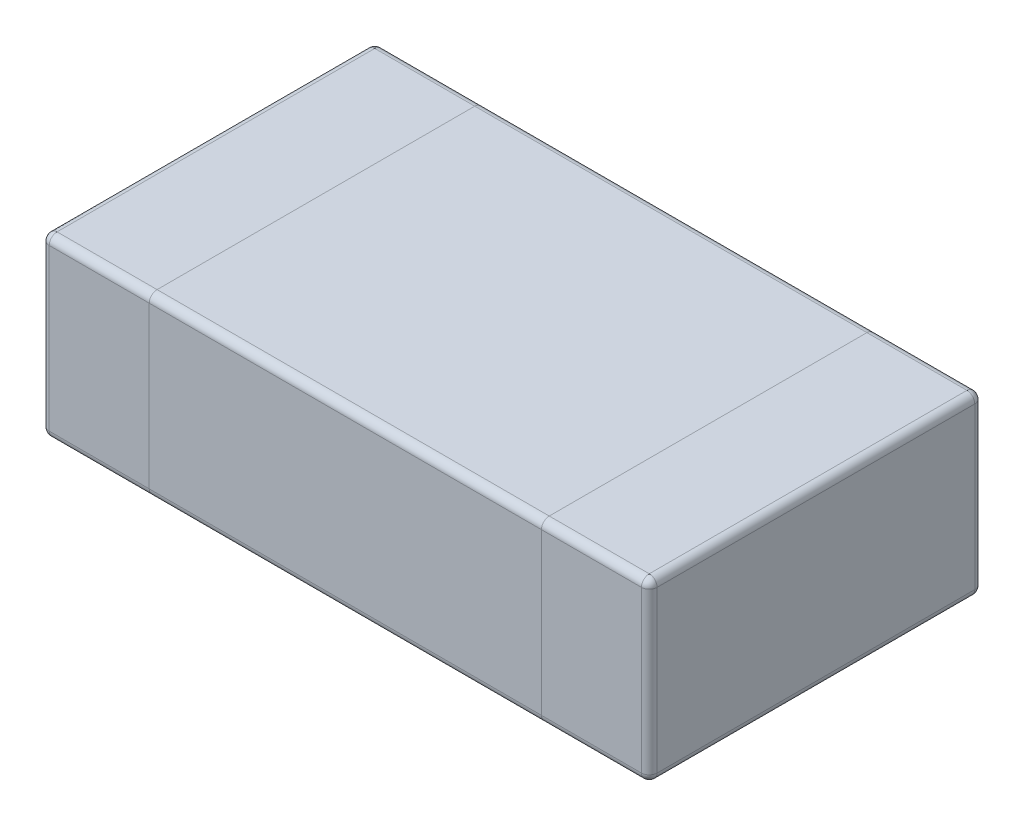
ISO-10303-21;
HEADER;
FILE_DESCRIPTION(('STEP AP214'),'2;1');
FILE_NAME('part.step','',(''),(''),'','','');
FILE_SCHEMA(('AUTOMOTIVE_DESIGN { 1 0 10303 214 1 1 1 1 }'));
ENDSEC;
DATA;
#1=APPLICATION_CONTEXT('core data for automotive mechanical design processes');
#2=APPLICATION_PROTOCOL_DEFINITION('international standard','automotive_design',2000,#1);
#3=PRODUCT_CONTEXT('',#1,'mechanical');
#4=PRODUCT('Part','Part','',(#3));
#5=PRODUCT_RELATED_PRODUCT_CATEGORY('part','',(#4));
#6=PRODUCT_DEFINITION_FORMATION('','',#4);
#7=PRODUCT_DEFINITION_CONTEXT('part definition',#1,'design');
#8=PRODUCT_DEFINITION('design','',#6,#7);
#9=PRODUCT_DEFINITION_SHAPE('','',#8);
#10=(LENGTH_UNIT() NAMED_UNIT(*) SI_UNIT(.MILLI.,.METRE.));
#11=(NAMED_UNIT(*) PLANE_ANGLE_UNIT() SI_UNIT($,.RADIAN.));
#12=(NAMED_UNIT(*) SI_UNIT($,.STERADIAN.) SOLID_ANGLE_UNIT());
#13=UNCERTAINTY_MEASURE_WITH_UNIT(LENGTH_MEASURE(1.E-05),#10,'distance_accuracy_value','');
#14=(GEOMETRIC_REPRESENTATION_CONTEXT(3) GLOBAL_UNCERTAINTY_ASSIGNED_CONTEXT((#13)) GLOBAL_UNIT_ASSIGNED_CONTEXT((#10,
#11,#12)) REPRESENTATION_CONTEXT('',''));
#15=CARTESIAN_POINT('',(0.,0.,0.));
#16=DIRECTION('',(0.,0.,1.));
#17=DIRECTION('',(1.,0.,0.));
#18=AXIS2_PLACEMENT_3D('',#15,#16,#17);
#19=CARTESIAN_POINT('',(-0.755,-0.225,0.405));
#20=DIRECTION('',(0.,1.,0.));
#21=DIRECTION('',(0.,0.,1.));
#22=AXIS2_PLACEMENT_3D('',#19,#20,#21);
#23=PLANE('',#22);
#24=DIRECTION('',(0.,0.,-1.));
#25=VECTOR('',#24,1.);
#26=CARTESIAN_POINT('',(-0.5,-0.225,0.405));
#27=LINE('',#26,#25);
#28=CARTESIAN_POINT('',(-0.5,-0.225,0.405));
#29=VERTEX_POINT('',#28);
#30=CARTESIAN_POINT('',(-0.5,-0.225,-0.405));
#31=VERTEX_POINT('',#30);
#32=EDGE_CURVE('E207',#29,#31,#27,.T.);
#33=ORIENTED_EDGE('',*,*,#32,.F.);
#34=DIRECTION('',(1.,0.,0.));
#35=VECTOR('',#34,1.);
#36=CARTESIAN_POINT('',(-0.755,-0.225,0.405));
#37=LINE('',#36,#35);
#38=CARTESIAN_POINT('',(-0.755,-0.225,0.405));
#39=VERTEX_POINT('',#38);
#40=EDGE_CURVE('E230',#29,#39,#37,.F.);
#41=ORIENTED_EDGE('',*,*,#40,.T.);
#42=DIRECTION('',(0.,0.,1.));
#43=VECTOR('',#42,1.);
#44=CARTESIAN_POINT('',(-0.755,-0.225,0.405));
#45=LINE('',#44,#43);
#46=CARTESIAN_POINT('',(-0.755,-0.225,-0.405));
#47=VERTEX_POINT('',#46);
#48=EDGE_CURVE('E228',#39,#47,#45,.F.);
#49=ORIENTED_EDGE('',*,*,#48,.T.);
#50=DIRECTION('',(-1.,0.,0.));
#51=VECTOR('',#50,1.);
#52=CARTESIAN_POINT('',(-0.755,-0.225,-0.405));
#53=LINE('',#52,#51);
#54=EDGE_CURVE('E226',#47,#31,#53,.F.);
#55=ORIENTED_EDGE('',*,*,#54,.T.);
#56=EDGE_LOOP('',(#33,#41,#49,#55));
#57=FACE_BOUND('',#56,.T.);
#58=ADVANCED_FACE('F36',(#57),#23,.F.);
#59=DIRECTION('',(0.,0.,-1.));
#60=VECTOR('',#59,1.);
#61=CARTESIAN_POINT('',(0.5,-0.225,0.405));
#62=LINE('',#61,#60);
#63=CARTESIAN_POINT('',(0.5,-0.225,0.405));
#64=VERTEX_POINT('',#63);
#65=CARTESIAN_POINT('',(0.5,-0.225,-0.405));
#66=VERTEX_POINT('',#65);
#67=EDGE_CURVE('E213',#64,#66,#62,.T.);
#68=ORIENTED_EDGE('',*,*,#67,.F.);
#69=DIRECTION('',(1.,0.,0.));
#70=VECTOR('',#69,1.);
#71=CARTESIAN_POINT('',(-0.755,-0.225,0.405));
#72=LINE('',#71,#70);
#73=EDGE_CURVE('E218',#64,#29,#72,.F.);
#74=ORIENTED_EDGE('',*,*,#73,.T.);
#75=ORIENTED_EDGE('',*,*,#32,.T.);
#76=DIRECTION('',(-1.,0.,0.));
#77=VECTOR('',#76,1.);
#78=CARTESIAN_POINT('',(-0.755,-0.225,-0.405));
#79=LINE('',#78,#77);
#80=EDGE_CURVE('E209',#31,#66,#79,.F.);
#81=ORIENTED_EDGE('',*,*,#80,.T.);
#82=EDGE_LOOP('',(#68,#74,#75,#81));
#83=FACE_BOUND('',#82,.T.);
#84=ADVANCED_FACE('F444',(#83),#23,.F.);
#85=CARTESIAN_POINT('',(-0.755,0.225,-0.425));
#86=DIRECTION('',(0.,0.,1.));
#87=DIRECTION('',(1.,0.,0.));
#88=AXIS2_PLACEMENT_3D('',#85,#86,#87);
#89=PLANE('',#88);
#90=DIRECTION('',(0.,-1.,0.));
#91=VECTOR('',#90,1.);
#92=CARTESIAN_POINT('',(0.5,0.225,-0.425));
#93=LINE('',#92,#91);
#94=CARTESIAN_POINT('',(0.5,0.205,-0.425));
#95=VERTEX_POINT('',#94);
#96=CARTESIAN_POINT('',(0.5,-0.205,-0.425));
#97=VERTEX_POINT('',#96);
#98=EDGE_CURVE('E193',#95,#97,#93,.T.);
#99=ORIENTED_EDGE('',*,*,#98,.T.);
#100=DIRECTION('',(-1.,0.,0.));
#101=VECTOR('',#100,1.);
#102=CARTESIAN_POINT('',(-0.755,-0.205,-0.425));
#103=LINE('',#102,#101);
#104=CARTESIAN_POINT('',(-0.5,-0.205,-0.425));
#105=VERTEX_POINT('',#104);
#106=EDGE_CURVE('E250',#97,#105,#103,.T.);
#107=ORIENTED_EDGE('',*,*,#106,.T.);
#108=DIRECTION('',(0.,-1.,0.));
#109=VECTOR('',#108,1.);
#110=CARTESIAN_POINT('',(-0.5,0.225,-0.425));
#111=LINE('',#110,#109);
#112=CARTESIAN_POINT('',(-0.5,0.205,-0.425));
#113=VERTEX_POINT('',#112);
#114=EDGE_CURVE('E400',#113,#105,#111,.T.);
#115=ORIENTED_EDGE('',*,*,#114,.F.);
#116=DIRECTION('',(-1.,0.,0.));
#117=VECTOR('',#116,1.);
#118=CARTESIAN_POINT('',(0.5,0.205,-0.425));
#119=LINE('',#118,#117);
#120=EDGE_CURVE('E248',#113,#95,#119,.F.);
#121=ORIENTED_EDGE('',*,*,#120,.T.);
#122=EDGE_LOOP('',(#99,#107,#115,#121));
#123=FACE_BOUND('',#122,.T.);
#124=ADVANCED_FACE('F505',(#123),#89,.F.);
#125=DIRECTION('',(0.,-1.,0.));
#126=VECTOR('',#125,1.);
#127=CARTESIAN_POINT('',(0.755,0.225,-0.425));
#128=LINE('',#127,#126);
#129=CARTESIAN_POINT('',(0.755,0.205,-0.425));
#130=VERTEX_POINT('',#129);
#131=CARTESIAN_POINT('',(0.755,-0.205,-0.425));
#132=VERTEX_POINT('',#131);
#133=EDGE_CURVE('E365',#130,#132,#128,.T.);
#134=ORIENTED_EDGE('',*,*,#133,.T.);
#135=DIRECTION('',(-1.,0.,0.));
#136=VECTOR('',#135,1.);
#137=CARTESIAN_POINT('',(-0.755,-0.205,-0.425));
#138=LINE('',#137,#136);
#139=EDGE_CURVE('E254',#132,#97,#138,.T.);
#140=ORIENTED_EDGE('',*,*,#139,.T.);
#141=ORIENTED_EDGE('',*,*,#98,.F.);
#142=DIRECTION('',(-1.,0.,0.));
#143=VECTOR('',#142,1.);
#144=CARTESIAN_POINT('',(0.755,0.205,-0.425));
#145=LINE('',#144,#143);
#146=EDGE_CURVE('E252',#95,#130,#145,.F.);
#147=ORIENTED_EDGE('',*,*,#146,.T.);
#148=EDGE_LOOP('',(#134,#140,#141,#147));
#149=FACE_BOUND('',#148,.T.);
#150=ADVANCED_FACE('F364',(#149),#89,.F.);
#151=CARTESIAN_POINT('',(-0.755,0.225,0.425));
#152=DIRECTION('',(0.,0.,-1.));
#153=DIRECTION('',(-1.,0.,0.));
#154=AXIS2_PLACEMENT_3D('',#151,#152,#153);
#155=PLANE('',#154);
#156=DIRECTION('',(0.,-1.,0.));
#157=VECTOR('',#156,1.);
#158=CARTESIAN_POINT('',(-0.5,0.225,0.425));
#159=LINE('',#158,#157);
#160=CARTESIAN_POINT('',(-0.5,0.205,0.425));
#161=VERTEX_POINT('',#160);
#162=CARTESIAN_POINT('',(-0.5,-0.205,0.425));
#163=VERTEX_POINT('',#162);
#164=EDGE_CURVE('E194',#161,#163,#159,.T.);
#165=ORIENTED_EDGE('',*,*,#164,.T.);
#166=DIRECTION('',(1.,0.,0.));
#167=VECTOR('',#166,1.);
#168=CARTESIAN_POINT('',(-0.755,-0.205,0.425));
#169=LINE('',#168,#167);
#170=CARTESIAN_POINT('',(0.5,-0.205,0.425));
#171=VERTEX_POINT('',#170);
#172=EDGE_CURVE('E191',#163,#171,#169,.T.);
#173=ORIENTED_EDGE('',*,*,#172,.T.);
#174=DIRECTION('',(0.,-1.,0.));
#175=VECTOR('',#174,1.);
#176=CARTESIAN_POINT('',(0.5,0.225,0.425));
#177=LINE('',#176,#175);
#178=CARTESIAN_POINT('',(0.5,0.205,0.425));
#179=VERTEX_POINT('',#178);
#180=EDGE_CURVE('E176',#179,#171,#177,.T.);
#181=ORIENTED_EDGE('',*,*,#180,.F.);
#182=DIRECTION('',(1.,0.,0.));
#183=VECTOR('',#182,1.);
#184=CARTESIAN_POINT('',(-0.5,0.205,0.425));
#185=LINE('',#184,#183);
#186=EDGE_CURVE('E188',#179,#161,#185,.F.);
#187=ORIENTED_EDGE('',*,*,#186,.T.);
#188=EDGE_LOOP('',(#165,#173,#181,#187));
#189=FACE_BOUND('',#188,.T.);
#190=ADVANCED_FACE('F186',(#189),#155,.F.);
#191=DIRECTION('',(0.,-1.,0.));
#192=VECTOR('',#191,1.);
#193=CARTESIAN_POINT('',(-0.755,0.225,0.425));
#194=LINE('',#193,#192);
#195=CARTESIAN_POINT('',(-0.755,0.205,0.425));
#196=VERTEX_POINT('',#195);
#197=CARTESIAN_POINT('',(-0.755,-0.205,0.425));
#198=VERTEX_POINT('',#197);
#199=EDGE_CURVE('E386',#196,#198,#194,.T.);
#200=ORIENTED_EDGE('',*,*,#199,.T.);
#201=DIRECTION('',(1.,0.,0.));
#202=VECTOR('',#201,1.);
#203=CARTESIAN_POINT('',(-0.755,-0.205,0.425));
#204=LINE('',#203,#202);
#205=EDGE_CURVE('E224',#198,#163,#204,.T.);
#206=ORIENTED_EDGE('',*,*,#205,.T.);
#207=ORIENTED_EDGE('',*,*,#164,.F.);
#208=DIRECTION('',(1.,0.,0.));
#209=VECTOR('',#208,1.);
#210=CARTESIAN_POINT('',(-0.755,0.205,0.425));
#211=LINE('',#210,#209);
#212=EDGE_CURVE('E221',#161,#196,#211,.F.);
#213=ORIENTED_EDGE('',*,*,#212,.T.);
#214=EDGE_LOOP('',(#200,#206,#207,#213));
#215=FACE_BOUND('',#214,.T.);
#216=ADVANCED_FACE('F480',(#215),#155,.F.);
#217=CARTESIAN_POINT('',(-0.755,0.225,0.405));
#218=DIRECTION('',(0.,1.,0.));
#219=DIRECTION('',(0.,0.,1.));
#220=AXIS2_PLACEMENT_3D('',#217,#218,#219);
#221=PLANE('',#220);
#222=DIRECTION('',(0.,0.,-1.));
#223=VECTOR('',#222,1.);
#224=CARTESIAN_POINT('',(0.755,0.225,-0.405));
#225=LINE('',#224,#223);
#226=CARTESIAN_POINT('',(0.755,0.225,0.405));
#227=VERTEX_POINT('',#226);
#228=CARTESIAN_POINT('',(0.755,0.225,-0.405));
#229=VERTEX_POINT('',#228);
#230=EDGE_CURVE('E53',#227,#229,#225,.T.);
#231=ORIENTED_EDGE('',*,*,#230,.T.);
#232=DIRECTION('',(-1.,0.,0.));
#233=VECTOR('',#232,1.);
#234=CARTESIAN_POINT('',(0.5,0.225,-0.405));
#235=LINE('',#234,#233);
#236=CARTESIAN_POINT('',(0.5,0.225,-0.405));
#237=VERTEX_POINT('',#236);
#238=EDGE_CURVE('E287',#229,#237,#235,.T.);
#239=ORIENTED_EDGE('',*,*,#238,.T.);
#240=DIRECTION('',(0.,0.,1.));
#241=VECTOR('',#240,1.);
#242=CARTESIAN_POINT('',(0.5,0.225,0.405));
#243=LINE('',#242,#241);
#244=CARTESIAN_POINT('',(0.5,0.225,0.405));
#245=VERTEX_POINT('',#244);
#246=EDGE_CURVE('E393',#237,#245,#243,.T.);
#247=ORIENTED_EDGE('',*,*,#246,.T.);
#248=DIRECTION('',(1.,0.,0.));
#249=VECTOR('',#248,1.);
#250=CARTESIAN_POINT('',(0.755,0.225,0.405));
#251=LINE('',#250,#249);
#252=EDGE_CURVE('E58',#245,#227,#251,.T.);
#253=ORIENTED_EDGE('',*,*,#252,.T.);
#254=EDGE_LOOP('',(#231,#239,#247,#253));
#255=FACE_BOUND('',#254,.T.);
#256=ADVANCED_FACE('F491',(#255),#221,.T.);
#257=ORIENTED_EDGE('',*,*,#246,.F.);
#258=DIRECTION('',(-1.,0.,0.));
#259=VECTOR('',#258,1.);
#260=CARTESIAN_POINT('',(-0.5,0.225,-0.405));
#261=LINE('',#260,#259);
#262=CARTESIAN_POINT('',(-0.5,0.225,-0.405));
#263=VERTEX_POINT('',#262);
#264=EDGE_CURVE('E283',#237,#263,#261,.T.);
#265=ORIENTED_EDGE('',*,*,#264,.T.);
#266=DIRECTION('',(0.,0.,1.));
#267=VECTOR('',#266,1.);
#268=CARTESIAN_POINT('',(-0.5,0.225,0.405));
#269=LINE('',#268,#267);
#270=CARTESIAN_POINT('',(-0.5,0.225,0.405));
#271=VERTEX_POINT('',#270);
#272=EDGE_CURVE('E389',#263,#271,#269,.T.);
#273=ORIENTED_EDGE('',*,*,#272,.T.);
#274=DIRECTION('',(1.,0.,0.));
#275=VECTOR('',#274,1.);
#276=CARTESIAN_POINT('',(0.5,0.225,0.405));
#277=LINE('',#276,#275);
#278=EDGE_CURVE('E281',#271,#245,#277,.T.);
#279=ORIENTED_EDGE('',*,*,#278,.T.);
#280=EDGE_LOOP('',(#257,#265,#273,#279));
#281=FACE_BOUND('',#280,.T.);
#282=ADVANCED_FACE('F490',(#281),#221,.T.);
#283=CARTESIAN_POINT('',(-0.755,0.225,0.405));
#284=DIRECTION('',(0.,-1.,0.));
#285=DIRECTION('',(0.,0.,-1.));
#286=AXIS2_PLACEMENT_3D('',#283,#284,#285);
#287=CYLINDRICAL_SURFACE('',#286,0.0200000000000001);
#288=DIRECTION('',(0.,-1.,0.));
#289=VECTOR('',#288,1.);
#290=CARTESIAN_POINT('',(-0.775,0.225,0.405));
#291=LINE('',#290,#289);
#292=CARTESIAN_POINT('',(-0.775,0.205,0.405));
#293=VERTEX_POINT('',#292);
#294=CARTESIAN_POINT('',(-0.775,-0.205,0.405));
#295=VERTEX_POINT('',#294);
#296=EDGE_CURVE('E324',#293,#295,#291,.T.);
#297=ORIENTED_EDGE('',*,*,#296,.T.);
#298=CARTESIAN_POINT('',(-0.755,-0.205,0.405));
#299=DIRECTION('',(0.,-1.,0.));
#300=DIRECTION('',(0.,0.,-1.));
#301=AXIS2_PLACEMENT_3D('',#298,#299,#300);
#302=CIRCLE('',#301,0.0200000000000001);
#303=EDGE_CURVE('E234',#295,#198,#302,.F.);
#304=ORIENTED_EDGE('',*,*,#303,.T.);
#305=ORIENTED_EDGE('',*,*,#199,.F.);
#306=CARTESIAN_POINT('',(-0.755,0.205,0.405));
#307=DIRECTION('',(0.,-1.,0.));
#308=DIRECTION('',(0.,0.,-1.));
#309=AXIS2_PLACEMENT_3D('',#306,#307,#308);
#310=CIRCLE('',#309,0.0200000000000001);
#311=EDGE_CURVE('E232',#196,#293,#310,.T.);
#312=ORIENTED_EDGE('',*,*,#311,.T.);
#313=EDGE_LOOP('',(#297,#304,#305,#312));
#314=FACE_BOUND('',#313,.T.);
#315=ADVANCED_FACE('F469',(#314),#287,.T.);
#316=DIRECTION('',(0.,-1.,0.));
#317=VECTOR('',#316,1.);
#318=CARTESIAN_POINT('',(0.755,0.225,0.425));
#319=LINE('',#318,#317);
#320=CARTESIAN_POINT('',(0.755,0.205,0.425));
#321=VERTEX_POINT('',#320);
#322=CARTESIAN_POINT('',(0.755,-0.205,0.425));
#323=VERTEX_POINT('',#322);
#324=EDGE_CURVE('E178',#321,#323,#319,.T.);
#325=ORIENTED_EDGE('',*,*,#324,.F.);
#326=DIRECTION('',(1.,0.,0.));
#327=VECTOR('',#326,1.);
#328=CARTESIAN_POINT('',(0.5,0.205,0.425));
#329=LINE('',#328,#327);
#330=EDGE_CURVE('E11',#321,#179,#329,.F.);
#331=ORIENTED_EDGE('',*,*,#330,.T.);
#332=ORIENTED_EDGE('',*,*,#180,.T.);
#333=DIRECTION('',(1.,0.,0.));
#334=VECTOR('',#333,1.);
#335=CARTESIAN_POINT('',(-0.755,-0.205,0.425));
#336=LINE('',#335,#334);
#337=EDGE_CURVE('E45',#171,#323,#336,.T.);
#338=ORIENTED_EDGE('',*,*,#337,.T.);
#339=EDGE_LOOP('',(#325,#331,#332,#338));
#340=FACE_BOUND('',#339,.T.);
#341=ADVANCED_FACE('F175',(#340),#155,.F.);
#342=CARTESIAN_POINT('',(0.755,0.225,0.405));
#343=DIRECTION('',(0.,-1.,0.));
#344=DIRECTION('',(0.,0.,-1.));
#345=AXIS2_PLACEMENT_3D('',#342,#343,#344);
#346=CYLINDRICAL_SURFACE('',#345,0.0200000000000001);
#347=ORIENTED_EDGE('',*,*,#324,.T.);
#348=CARTESIAN_POINT('',(0.755,-0.205,0.405));
#349=DIRECTION('',(0.,-1.,0.));
#350=DIRECTION('',(0.,0.,-1.));
#351=AXIS2_PLACEMENT_3D('',#348,#349,#350);
#352=CIRCLE('',#351,0.0200000000000001);
#353=CARTESIAN_POINT('',(0.775,-0.205,0.405));
#354=VERTEX_POINT('',#353);
#355=EDGE_CURVE('E272',#323,#354,#352,.F.);
#356=ORIENTED_EDGE('',*,*,#355,.T.);
#357=DIRECTION('',(0.,-1.,0.));
#358=VECTOR('',#357,1.);
#359=CARTESIAN_POINT('',(0.775,0.225,0.405));
#360=LINE('',#359,#358);
#361=CARTESIAN_POINT('',(0.775,0.205,0.405));
#362=VERTEX_POINT('',#361);
#363=EDGE_CURVE('E376',#362,#354,#360,.T.);
#364=ORIENTED_EDGE('',*,*,#363,.F.);
#365=CARTESIAN_POINT('',(0.755,0.205,0.405));
#366=DIRECTION('',(0.,-1.,0.));
#367=DIRECTION('',(0.,0.,-1.));
#368=AXIS2_PLACEMENT_3D('',#365,#366,#367);
#369=CIRCLE('',#368,0.0200000000000001);
#370=EDGE_CURVE('E270',#362,#321,#369,.T.);
#371=ORIENTED_EDGE('',*,*,#370,.T.);
#372=EDGE_LOOP('',(#347,#356,#364,#371));
#373=FACE_BOUND('',#372,.T.);
#374=ADVANCED_FACE('F830',(#373),#346,.T.);
#375=CARTESIAN_POINT('',(0.775,0.225,0.405));
#376=DIRECTION('',(-1.,0.,0.));
#377=DIRECTION('',(0.,0.,1.));
#378=AXIS2_PLACEMENT_3D('',#375,#376,#377);
#379=PLANE('',#378);
#380=ORIENTED_EDGE('',*,*,#363,.T.);
#381=DIRECTION('',(0.,0.,-1.));
#382=VECTOR('',#381,1.);
#383=CARTESIAN_POINT('',(0.775,-0.205,0.405));
#384=LINE('',#383,#382);
#385=CARTESIAN_POINT('',(0.775,-0.205,-0.405));
#386=VERTEX_POINT('',#385);
#387=EDGE_CURVE('E268',#354,#386,#384,.T.);
#388=ORIENTED_EDGE('',*,*,#387,.T.);
#389=DIRECTION('',(0.,-1.,0.));
#390=VECTOR('',#389,1.);
#391=CARTESIAN_POINT('',(0.775,0.225,-0.405));
#392=LINE('',#391,#390);
#393=CARTESIAN_POINT('',(0.775,0.205,-0.405));
#394=VERTEX_POINT('',#393);
#395=EDGE_CURVE('E373',#394,#386,#392,.T.);
#396=ORIENTED_EDGE('',*,*,#395,.F.);
#397=DIRECTION('',(0.,0.,-1.));
#398=VECTOR('',#397,1.);
#399=CARTESIAN_POINT('',(0.775,0.205,0.405));
#400=LINE('',#399,#398);
#401=EDGE_CURVE('E266',#394,#362,#400,.F.);
#402=ORIENTED_EDGE('',*,*,#401,.T.);
#403=EDGE_LOOP('',(#380,#388,#396,#402));
#404=FACE_BOUND('',#403,.T.);
#405=ADVANCED_FACE('F820',(#404),#379,.F.);
#406=CARTESIAN_POINT('',(0.755,0.225,-0.405));
#407=DIRECTION('',(0.,-1.,0.));
#408=DIRECTION('',(0.,0.,-1.));
#409=AXIS2_PLACEMENT_3D('',#406,#407,#408);
#410=CYLINDRICAL_SURFACE('',#409,0.0200000000000001);
#411=ORIENTED_EDGE('',*,*,#395,.T.);
#412=CARTESIAN_POINT('',(0.755,-0.205,-0.405));
#413=DIRECTION('',(0.,-1.,0.));
#414=DIRECTION('',(0.,0.,-1.));
#415=AXIS2_PLACEMENT_3D('',#412,#413,#414);
#416=CIRCLE('',#415,0.0200000000000001);
#417=EDGE_CURVE('E264',#386,#132,#416,.F.);
#418=ORIENTED_EDGE('',*,*,#417,.T.);
#419=ORIENTED_EDGE('',*,*,#133,.F.);
#420=CARTESIAN_POINT('',(0.755,0.205,-0.405));
#421=DIRECTION('',(0.,-1.,0.));
#422=DIRECTION('',(0.,0.,-1.));
#423=AXIS2_PLACEMENT_3D('',#420,#421,#422);
#424=CIRCLE('',#423,0.0200000000000001);
#425=EDGE_CURVE('E262',#130,#394,#424,.T.);
#426=ORIENTED_EDGE('',*,*,#425,.T.);
#427=EDGE_LOOP('',(#411,#418,#419,#426));
#428=FACE_BOUND('',#427,.T.);
#429=ADVANCED_FACE('F370',(#428),#410,.T.);
#430=ORIENTED_EDGE('',*,*,#114,.T.);
#431=DIRECTION('',(-1.,0.,0.));
#432=VECTOR('',#431,1.);
#433=CARTESIAN_POINT('',(-0.755,-0.205,-0.425));
#434=LINE('',#433,#432);
#435=CARTESIAN_POINT('',(-0.755,-0.205,-0.425));
#436=VERTEX_POINT('',#435);
#437=EDGE_CURVE('E246',#105,#436,#434,.T.);
#438=ORIENTED_EDGE('',*,*,#437,.T.);
#439=DIRECTION('',(0.,-1.,0.));
#440=VECTOR('',#439,1.);
#441=CARTESIAN_POINT('',(-0.755,0.225,-0.425));
#442=LINE('',#441,#440);
#443=CARTESIAN_POINT('',(-0.755,0.205,-0.425));
#444=VERTEX_POINT('',#443);
#445=EDGE_CURVE('E374',#444,#436,#442,.T.);
#446=ORIENTED_EDGE('',*,*,#445,.F.);
#447=DIRECTION('',(-1.,0.,0.));
#448=VECTOR('',#447,1.);
#449=CARTESIAN_POINT('',(-0.5,0.205,-0.425));
#450=LINE('',#449,#448);
#451=EDGE_CURVE('E244',#444,#113,#450,.F.);
#452=ORIENTED_EDGE('',*,*,#451,.T.);
#453=EDGE_LOOP('',(#430,#438,#446,#452));
#454=FACE_BOUND('',#453,.T.);
#455=ADVANCED_FACE('F797',(#454),#89,.F.);
#456=CARTESIAN_POINT('',(-0.755,0.225,-0.405));
#457=DIRECTION('',(0.,-1.,0.));
#458=DIRECTION('',(0.,0.,-1.));
#459=AXIS2_PLACEMENT_3D('',#456,#457,#458);
#460=CYLINDRICAL_SURFACE('',#459,0.0200000000000001);
#461=ORIENTED_EDGE('',*,*,#445,.T.);
#462=CARTESIAN_POINT('',(-0.755,-0.205,-0.405));
#463=DIRECTION('',(0.,-1.,0.));
#464=DIRECTION('',(0.,0.,-1.));
#465=AXIS2_PLACEMENT_3D('',#462,#463,#464);
#466=CIRCLE('',#465,0.0200000000000001);
#467=CARTESIAN_POINT('',(-0.775,-0.205,-0.405));
#468=VERTEX_POINT('',#467);
#469=EDGE_CURVE('E242',#436,#468,#466,.F.);
#470=ORIENTED_EDGE('',*,*,#469,.T.);
#471=DIRECTION('',(0.,-1.,0.));
#472=VECTOR('',#471,1.);
#473=CARTESIAN_POINT('',(-0.775,0.225,-0.405));
#474=LINE('',#473,#472);
#475=CARTESIAN_POINT('',(-0.775,0.205,-0.405));
#476=VERTEX_POINT('',#475);
#477=EDGE_CURVE('E379',#476,#468,#474,.T.);
#478=ORIENTED_EDGE('',*,*,#477,.F.);
#479=CARTESIAN_POINT('',(-0.755,0.205,-0.405));
#480=DIRECTION('',(0.,-1.,0.));
#481=DIRECTION('',(0.,0.,-1.));
#482=AXIS2_PLACEMENT_3D('',#479,#480,#481);
#483=CIRCLE('',#482,0.0200000000000001);
#484=EDGE_CURVE('E240',#476,#444,#483,.T.);
#485=ORIENTED_EDGE('',*,*,#484,.T.);
#486=EDGE_LOOP('',(#461,#470,#478,#485));
#487=FACE_BOUND('',#486,.T.);
#488=ADVANCED_FACE('F787',(#487),#460,.T.);
#489=CARTESIAN_POINT('',(-0.775,0.225,0.405));
#490=DIRECTION('',(1.,0.,0.));
#491=DIRECTION('',(0.,0.,-1.));
#492=AXIS2_PLACEMENT_3D('',#489,#490,#491);
#493=PLANE('',#492);
#494=ORIENTED_EDGE('',*,*,#477,.T.);
#495=DIRECTION('',(0.,0.,1.));
#496=VECTOR('',#495,1.);
#497=CARTESIAN_POINT('',(-0.775,-0.205,0.405));
#498=LINE('',#497,#496);
#499=EDGE_CURVE('E238',#468,#295,#498,.T.);
#500=ORIENTED_EDGE('',*,*,#499,.T.);
#501=ORIENTED_EDGE('',*,*,#296,.F.);
#502=DIRECTION('',(0.,0.,1.));
#503=VECTOR('',#502,1.);
#504=CARTESIAN_POINT('',(-0.775,0.205,-0.405));
#505=LINE('',#504,#503);
#506=EDGE_CURVE('E236',#293,#476,#505,.F.);
#507=ORIENTED_EDGE('',*,*,#506,.T.);
#508=EDGE_LOOP('',(#494,#500,#501,#507));
#509=FACE_BOUND('',#508,.T.);
#510=ADVANCED_FACE('F465',(#509),#493,.F.);
#511=DIRECTION('',(0.,0.,1.));
#512=VECTOR('',#511,1.);
#513=CARTESIAN_POINT('',(-0.755,0.225,0.405));
#514=LINE('',#513,#512);
#515=CARTESIAN_POINT('',(-0.755,0.225,-0.405));
#516=VERTEX_POINT('',#515);
#517=CARTESIAN_POINT('',(-0.755,0.225,0.405));
#518=VERTEX_POINT('',#517);
#519=EDGE_CURVE('E276',#516,#518,#514,.T.);
#520=ORIENTED_EDGE('',*,*,#519,.T.);
#521=DIRECTION('',(1.,0.,0.));
#522=VECTOR('',#521,1.);
#523=CARTESIAN_POINT('',(-0.5,0.225,0.405));
#524=LINE('',#523,#522);
#525=EDGE_CURVE('E278',#518,#271,#524,.T.);
#526=ORIENTED_EDGE('',*,*,#525,.T.);
#527=ORIENTED_EDGE('',*,*,#272,.F.);
#528=DIRECTION('',(-1.,0.,0.));
#529=VECTOR('',#528,1.);
#530=CARTESIAN_POINT('',(-0.755,0.225,-0.405));
#531=LINE('',#530,#529);
#532=EDGE_CURVE('E274',#263,#516,#531,.T.);
#533=ORIENTED_EDGE('',*,*,#532,.T.);
#534=EDGE_LOOP('',(#520,#526,#527,#533));
#535=FACE_BOUND('',#534,.T.);
#536=ADVANCED_FACE('F486',(#535),#221,.T.);
#537=ORIENTED_EDGE('',*,*,#67,.T.);
#538=DIRECTION('',(-1.,0.,0.));
#539=VECTOR('',#538,1.);
#540=CARTESIAN_POINT('',(-0.755,-0.225,-0.405));
#541=LINE('',#540,#539);
#542=CARTESIAN_POINT('',(0.755,-0.225,-0.405));
#543=VERTEX_POINT('',#542);
#544=EDGE_CURVE('E260',#66,#543,#541,.F.);
#545=ORIENTED_EDGE('',*,*,#544,.T.);
#546=DIRECTION('',(0.,0.,-1.));
#547=VECTOR('',#546,1.);
#548=CARTESIAN_POINT('',(0.755,-0.225,0.405));
#549=LINE('',#548,#547);
#550=CARTESIAN_POINT('',(0.755,-0.225,0.405));
#551=VERTEX_POINT('',#550);
#552=EDGE_CURVE('E258',#543,#551,#549,.F.);
#553=ORIENTED_EDGE('',*,*,#552,.T.);
#554=DIRECTION('',(1.,0.,0.));
#555=VECTOR('',#554,1.);
#556=CARTESIAN_POINT('',(-0.755,-0.225,0.405));
#557=LINE('',#556,#555);
#558=EDGE_CURVE('E256',#551,#64,#557,.F.);
#559=ORIENTED_EDGE('',*,*,#558,.T.);
#560=EDGE_LOOP('',(#537,#545,#553,#559));
#561=FACE_BOUND('',#560,.T.);
#562=ADVANCED_FACE('F410',(#561),#23,.F.);
#563=CARTESIAN_POINT('',(-0.755,-0.205,-0.405));
#564=DIRECTION('',(-1.,0.,0.));
#565=DIRECTION('',(0.,0.,1.));
#566=AXIS2_PLACEMENT_3D('',#563,#564,#565);
#567=CYLINDRICAL_SURFACE('',#566,0.02);
#568=CARTESIAN_POINT('',(0.5,-0.205,-0.405));
#569=DIRECTION('',(1.,0.,0.));
#570=DIRECTION('',(0.,0.,-1.));
#571=AXIS2_PLACEMENT_3D('',#568,#569,#570);
#572=CIRCLE('',#571,0.02);
#573=EDGE_CURVE('E318',#66,#97,#572,.T.);
#574=ORIENTED_EDGE('',*,*,#573,.F.);
#575=ORIENTED_EDGE('',*,*,#80,.F.);
#576=CARTESIAN_POINT('',(-0.5,-0.205,-0.405));
#577=DIRECTION('',(-1.,0.,0.));
#578=DIRECTION('',(0.,0.,1.));
#579=AXIS2_PLACEMENT_3D('',#576,#577,#578);
#580=CIRCLE('',#579,0.02);
#581=EDGE_CURVE('E321',#105,#31,#580,.T.);
#582=ORIENTED_EDGE('',*,*,#581,.F.);
#583=ORIENTED_EDGE('',*,*,#106,.F.);
#584=EDGE_LOOP('',(#574,#575,#582,#583));
#585=FACE_BOUND('',#584,.T.);
#586=ADVANCED_FACE('F419',(#585),#567,.T.);
#587=CARTESIAN_POINT('',(-0.755,-0.205,-0.405));
#588=DIRECTION('',(-1.,0.,0.));
#589=DIRECTION('',(0.,0.,1.));
#590=AXIS2_PLACEMENT_3D('',#587,#588,#589);
#591=CYLINDRICAL_SURFACE('',#590,0.02);
#592=ORIENTED_EDGE('',*,*,#581,.T.);
#593=ORIENTED_EDGE('',*,*,#54,.F.);
#594=CARTESIAN_POINT('',(-0.755,-0.205,-0.405));
#595=DIRECTION('',(-1.,0.,0.));
#596=DIRECTION('',(0.,0.,1.));
#597=AXIS2_PLACEMENT_3D('',#594,#595,#596);
#598=CIRCLE('',#597,0.02);
#599=EDGE_CURVE('E315',#436,#47,#598,.T.);
#600=ORIENTED_EDGE('',*,*,#599,.F.);
#601=ORIENTED_EDGE('',*,*,#437,.F.);
#602=EDGE_LOOP('',(#592,#593,#600,#601));
#603=FACE_BOUND('',#602,.T.);
#604=ADVANCED_FACE('F450',(#603),#591,.T.);
#605=CARTESIAN_POINT('',(-0.755,-0.205,-0.405));
#606=DIRECTION('',(-1.,0.,0.));
#607=DIRECTION('',(0.,0.,1.));
#608=AXIS2_PLACEMENT_3D('',#605,#606,#607);
#609=CYLINDRICAL_SURFACE('',#608,0.02);
#610=ORIENTED_EDGE('',*,*,#573,.T.);
#611=ORIENTED_EDGE('',*,*,#139,.F.);
#612=CARTESIAN_POINT('',(0.755,-0.205,-0.405));
#613=DIRECTION('',(1.,0.,0.));
#614=DIRECTION('',(0.,0.,-1.));
#615=AXIS2_PLACEMENT_3D('',#612,#613,#614);
#616=CIRCLE('',#615,0.02);
#617=EDGE_CURVE('E312',#543,#132,#616,.T.);
#618=ORIENTED_EDGE('',*,*,#617,.F.);
#619=ORIENTED_EDGE('',*,*,#544,.F.);
#620=EDGE_LOOP('',(#610,#611,#618,#619));
#621=FACE_BOUND('',#620,.T.);
#622=ADVANCED_FACE('F422',(#621),#609,.T.);
#623=CARTESIAN_POINT('',(-0.755,-0.205,-0.405));
#624=DIRECTION('',(0.,1.,0.));
#625=DIRECTION('',(0.,0.,1.));
#626=AXIS2_PLACEMENT_3D('',#623,#624,#625);
#627=SPHERICAL_SURFACE('',#626,0.02);
#628=ORIENTED_EDGE('',*,*,#469,.F.);
#629=ORIENTED_EDGE('',*,*,#599,.T.);
#630=CARTESIAN_POINT('',(-0.755,-0.205,-0.405));
#631=DIRECTION('',(0.,0.,1.));
#632=DIRECTION('',(1.,0.,0.));
#633=AXIS2_PLACEMENT_3D('',#630,#631,#632);
#634=CIRCLE('',#633,0.02);
#635=EDGE_CURVE('E309',#468,#47,#634,.T.);
#636=ORIENTED_EDGE('',*,*,#635,.F.);
#637=EDGE_LOOP('',(#628,#629,#636));
#638=FACE_BOUND('',#637,.T.);
#639=ADVANCED_FACE('F455',(#638),#627,.T.);
#640=CARTESIAN_POINT('',(0.755,-0.205,-0.405));
#641=DIRECTION('',(0.,1.,0.));
#642=DIRECTION('',(0.,0.,1.));
#643=AXIS2_PLACEMENT_3D('',#640,#641,#642);
#644=SPHERICAL_SURFACE('',#643,0.02);
#645=ORIENTED_EDGE('',*,*,#617,.T.);
#646=ORIENTED_EDGE('',*,*,#417,.F.);
#647=CARTESIAN_POINT('',(0.755,-0.205,-0.405));
#648=DIRECTION('',(0.,0.,1.));
#649=DIRECTION('',(1.,0.,0.));
#650=AXIS2_PLACEMENT_3D('',#647,#648,#649);
#651=CIRCLE('',#650,0.02);
#652=EDGE_CURVE('E306',#543,#386,#651,.T.);
#653=ORIENTED_EDGE('',*,*,#652,.F.);
#654=EDGE_LOOP('',(#645,#646,#653));
#655=FACE_BOUND('',#654,.T.);
#656=ADVANCED_FACE('F426',(#655),#644,.T.);
#657=CARTESIAN_POINT('',(-0.755,-0.205,0.405));
#658=DIRECTION('',(0.,0.,1.));
#659=DIRECTION('',(1.,0.,0.));
#660=AXIS2_PLACEMENT_3D('',#657,#658,#659);
#661=CYLINDRICAL_SURFACE('',#660,0.02);
#662=ORIENTED_EDGE('',*,*,#635,.T.);
#663=ORIENTED_EDGE('',*,*,#48,.F.);
#664=CARTESIAN_POINT('',(-0.755,-0.205,0.405));
#665=DIRECTION('',(0.,0.,1.));
#666=DIRECTION('',(1.,0.,0.));
#667=AXIS2_PLACEMENT_3D('',#664,#665,#666);
#668=CIRCLE('',#667,0.02);
#669=EDGE_CURVE('E303',#295,#39,#668,.T.);
#670=ORIENTED_EDGE('',*,*,#669,.F.);
#671=ORIENTED_EDGE('',*,*,#499,.F.);
#672=EDGE_LOOP('',(#662,#663,#670,#671));
#673=FACE_BOUND('',#672,.T.);
#674=ADVANCED_FACE('F458',(#673),#661,.T.);
#675=CARTESIAN_POINT('',(0.755,-0.205,0.405));
#676=DIRECTION('',(0.,0.,-1.));
#677=DIRECTION('',(-1.,0.,0.));
#678=AXIS2_PLACEMENT_3D('',#675,#676,#677);
#679=CYLINDRICAL_SURFACE('',#678,0.02);
#680=ORIENTED_EDGE('',*,*,#652,.T.);
#681=ORIENTED_EDGE('',*,*,#387,.F.);
#682=CARTESIAN_POINT('',(0.755,-0.205,0.405));
#683=DIRECTION('',(0.,0.,1.));
#684=DIRECTION('',(1.,0.,0.));
#685=AXIS2_PLACEMENT_3D('',#682,#683,#684);
#686=CIRCLE('',#685,0.02);
#687=EDGE_CURVE('E300',#551,#354,#686,.T.);
#688=ORIENTED_EDGE('',*,*,#687,.F.);
#689=ORIENTED_EDGE('',*,*,#552,.F.);
#690=EDGE_LOOP('',(#680,#681,#688,#689));
#691=FACE_BOUND('',#690,.T.);
#692=ADVANCED_FACE('F430',(#691),#679,.T.);
#693=CARTESIAN_POINT('',(-0.755,-0.205,0.405));
#694=DIRECTION('',(0.,1.,0.));
#695=DIRECTION('',(0.,0.,1.));
#696=AXIS2_PLACEMENT_3D('',#693,#694,#695);
#697=SPHERICAL_SURFACE('',#696,0.02);
#698=ORIENTED_EDGE('',*,*,#303,.F.);
#699=ORIENTED_EDGE('',*,*,#669,.T.);
#700=CARTESIAN_POINT('',(-0.755,-0.205,0.405));
#701=DIRECTION('',(1.,0.,0.));
#702=DIRECTION('',(0.,0.,-1.));
#703=AXIS2_PLACEMENT_3D('',#700,#701,#702);
#704=CIRCLE('',#703,0.02);
#705=EDGE_CURVE('E297',#198,#39,#704,.T.);
#706=ORIENTED_EDGE('',*,*,#705,.F.);
#707=EDGE_LOOP('',(#698,#699,#706));
#708=FACE_BOUND('',#707,.T.);
#709=ADVANCED_FACE('F568',(#708),#697,.T.);
#710=CARTESIAN_POINT('',(0.755,-0.205,0.405));
#711=DIRECTION('',(0.,1.,0.));
#712=DIRECTION('',(0.,0.,1.));
#713=AXIS2_PLACEMENT_3D('',#710,#711,#712);
#714=SPHERICAL_SURFACE('',#713,0.02);
#715=ORIENTED_EDGE('',*,*,#687,.T.);
#716=ORIENTED_EDGE('',*,*,#355,.F.);
#717=CARTESIAN_POINT('',(0.755,-0.205,0.405));
#718=DIRECTION('',(-1.,0.,0.));
#719=DIRECTION('',(0.,0.,1.));
#720=AXIS2_PLACEMENT_3D('',#717,#718,#719);
#721=CIRCLE('',#720,0.02);
#722=EDGE_CURVE('E294',#551,#323,#721,.T.);
#723=ORIENTED_EDGE('',*,*,#722,.F.);
#724=EDGE_LOOP('',(#715,#716,#723));
#725=FACE_BOUND('',#724,.T.);
#726=ADVANCED_FACE('F434',(#725),#714,.T.);
#727=CARTESIAN_POINT('',(-0.755,-0.205,0.405));
#728=DIRECTION('',(1.,0.,0.));
#729=DIRECTION('',(0.,0.,-1.));
#730=AXIS2_PLACEMENT_3D('',#727,#728,#729);
#731=CYLINDRICAL_SURFACE('',#730,0.02);
#732=ORIENTED_EDGE('',*,*,#705,.T.);
#733=ORIENTED_EDGE('',*,*,#40,.F.);
#734=CARTESIAN_POINT('',(-0.5,-0.205,0.405));
#735=DIRECTION('',(1.,0.,0.));
#736=DIRECTION('',(0.,0.,-1.));
#737=AXIS2_PLACEMENT_3D('',#734,#735,#736);
#738=CIRCLE('',#737,0.02);
#739=EDGE_CURVE('E292',#163,#29,#738,.T.);
#740=ORIENTED_EDGE('',*,*,#739,.F.);
#741=ORIENTED_EDGE('',*,*,#205,.F.);
#742=EDGE_LOOP('',(#732,#733,#740,#741));
#743=FACE_BOUND('',#742,.T.);
#744=ADVANCED_FACE('F559',(#743),#731,.T.);
#745=CARTESIAN_POINT('',(-0.755,-0.205,0.405));
#746=DIRECTION('',(1.,0.,0.));
#747=DIRECTION('',(0.,0.,-1.));
#748=AXIS2_PLACEMENT_3D('',#745,#746,#747);
#749=CYLINDRICAL_SURFACE('',#748,0.02);
#750=ORIENTED_EDGE('',*,*,#722,.T.);
#751=ORIENTED_EDGE('',*,*,#337,.F.);
#752=CARTESIAN_POINT('',(0.5,-0.205,0.405));
#753=DIRECTION('',(-1.,0.,0.));
#754=DIRECTION('',(0.,0.,1.));
#755=AXIS2_PLACEMENT_3D('',#752,#753,#754);
#756=CIRCLE('',#755,0.02);
#757=EDGE_CURVE('E290',#64,#171,#756,.T.);
#758=ORIENTED_EDGE('',*,*,#757,.F.);
#759=ORIENTED_EDGE('',*,*,#558,.F.);
#760=EDGE_LOOP('',(#750,#751,#758,#759));
#761=FACE_BOUND('',#760,.T.);
#762=ADVANCED_FACE('F438',(#761),#749,.T.);
#763=CARTESIAN_POINT('',(-0.755,-0.205,0.405));
#764=DIRECTION('',(1.,0.,0.));
#765=DIRECTION('',(0.,0.,-1.));
#766=AXIS2_PLACEMENT_3D('',#763,#764,#765);
#767=CYLINDRICAL_SURFACE('',#766,0.02);
#768=ORIENTED_EDGE('',*,*,#739,.T.);
#769=ORIENTED_EDGE('',*,*,#73,.F.);
#770=ORIENTED_EDGE('',*,*,#757,.T.);
#771=ORIENTED_EDGE('',*,*,#172,.F.);
#772=EDGE_LOOP('',(#768,#769,#770,#771));
#773=FACE_BOUND('',#772,.T.);
#774=ADVANCED_FACE('F440',(#773),#767,.T.);
#775=CARTESIAN_POINT('',(-0.755,0.205,-0.405));
#776=DIRECTION('',(1.,0.,0.));
#777=DIRECTION('',(0.,0.,-1.));
#778=AXIS2_PLACEMENT_3D('',#775,#776,#777);
#779=CYLINDRICAL_SURFACE('',#778,0.02);
#780=CARTESIAN_POINT('',(0.755,0.205,-0.405));
#781=DIRECTION('',(1.,0.,0.));
#782=DIRECTION('',(0.,0.,-1.));
#783=AXIS2_PLACEMENT_3D('',#780,#781,#782);
#784=CIRCLE('',#783,0.02);
#785=EDGE_CURVE('E345',#130,#229,#784,.T.);
#786=ORIENTED_EDGE('',*,*,#785,.F.);
#787=ORIENTED_EDGE('',*,*,#146,.F.);
#788=CARTESIAN_POINT('',(0.5,0.205,-0.405));
#789=DIRECTION('',(-1.,0.,0.));
#790=DIRECTION('',(0.,0.,1.));
#791=AXIS2_PLACEMENT_3D('',#788,#789,#790);
#792=CIRCLE('',#791,0.02);
#793=EDGE_CURVE('E40',#237,#95,#792,.T.);
#794=ORIENTED_EDGE('',*,*,#793,.F.);
#795=ORIENTED_EDGE('',*,*,#238,.F.);
#796=EDGE_LOOP('',(#786,#787,#794,#795));
#797=FACE_BOUND('',#796,.T.);
#798=ADVANCED_FACE('F38',(#797),#779,.T.);
#799=CARTESIAN_POINT('',(-0.755,0.205,-0.405));
#800=DIRECTION('',(1.,0.,0.));
#801=DIRECTION('',(0.,0.,-1.));
#802=AXIS2_PLACEMENT_3D('',#799,#800,#801);
#803=CYLINDRICAL_SURFACE('',#802,0.02);
#804=ORIENTED_EDGE('',*,*,#793,.T.);
#805=ORIENTED_EDGE('',*,*,#120,.F.);
#806=CARTESIAN_POINT('',(-0.5,0.205,-0.405));
#807=DIRECTION('',(-1.,0.,0.));
#808=DIRECTION('',(0.,0.,1.));
#809=AXIS2_PLACEMENT_3D('',#806,#807,#808);
#810=CIRCLE('',#809,0.02);
#811=EDGE_CURVE('E343',#263,#113,#810,.T.);
#812=ORIENTED_EDGE('',*,*,#811,.F.);
#813=ORIENTED_EDGE('',*,*,#264,.F.);
#814=EDGE_LOOP('',(#804,#805,#812,#813));
#815=FACE_BOUND('',#814,.T.);
#816=ADVANCED_FACE('F356',(#815),#803,.T.);
#817=CARTESIAN_POINT('',(0.755,0.205,-0.405));
#818=DIRECTION('',(0.,1.,0.));
#819=DIRECTION('',(0.,0.,1.));
#820=AXIS2_PLACEMENT_3D('',#817,#818,#819);
#821=SPHERICAL_SURFACE('',#820,0.02);
#822=ORIENTED_EDGE('',*,*,#425,.F.);
#823=ORIENTED_EDGE('',*,*,#785,.T.);
#824=CARTESIAN_POINT('',(0.755,0.205,-0.405));
#825=DIRECTION('',(0.,0.,1.));
#826=DIRECTION('',(1.,0.,0.));
#827=AXIS2_PLACEMENT_3D('',#824,#825,#826);
#828=CIRCLE('',#827,0.02);
#829=EDGE_CURVE('E340',#394,#229,#828,.T.);
#830=ORIENTED_EDGE('',*,*,#829,.F.);
#831=EDGE_LOOP('',(#822,#823,#830));
#832=FACE_BOUND('',#831,.T.);
#833=ADVANCED_FACE('F545',(#832),#821,.T.);
#834=CARTESIAN_POINT('',(-0.755,0.205,-0.405));
#835=DIRECTION('',(1.,0.,0.));
#836=DIRECTION('',(0.,0.,-1.));
#837=AXIS2_PLACEMENT_3D('',#834,#835,#836);
#838=CYLINDRICAL_SURFACE('',#837,0.02);
#839=ORIENTED_EDGE('',*,*,#811,.T.);
#840=ORIENTED_EDGE('',*,*,#451,.F.);
#841=CARTESIAN_POINT('',(-0.755,0.205,-0.405));
#842=DIRECTION('',(-1.,0.,0.));
#843=DIRECTION('',(0.,0.,1.));
#844=AXIS2_PLACEMENT_3D('',#841,#842,#843);
#845=CIRCLE('',#844,0.02);
#846=EDGE_CURVE('E337',#516,#444,#845,.T.);
#847=ORIENTED_EDGE('',*,*,#846,.F.);
#848=ORIENTED_EDGE('',*,*,#532,.F.);
#849=EDGE_LOOP('',(#839,#840,#847,#848));
#850=FACE_BOUND('',#849,.T.);
#851=ADVANCED_FACE('F541',(#850),#838,.T.);
#852=CARTESIAN_POINT('',(0.755,0.205,0.405));
#853=DIRECTION('',(0.,0.,1.));
#854=DIRECTION('',(1.,0.,0.));
#855=AXIS2_PLACEMENT_3D('',#852,#853,#854);
#856=CYLINDRICAL_SURFACE('',#855,0.02);
#857=ORIENTED_EDGE('',*,*,#829,.T.);
#858=ORIENTED_EDGE('',*,*,#230,.F.);
#859=CARTESIAN_POINT('',(0.755,0.205,0.405));
#860=DIRECTION('',(0.,0.,1.));
#861=DIRECTION('',(1.,0.,0.));
#862=AXIS2_PLACEMENT_3D('',#859,#860,#861);
#863=CIRCLE('',#862,0.02);
#864=EDGE_CURVE('E334',#362,#227,#863,.T.);
#865=ORIENTED_EDGE('',*,*,#864,.F.);
#866=ORIENTED_EDGE('',*,*,#401,.F.);
#867=EDGE_LOOP('',(#857,#858,#865,#866));
#868=FACE_BOUND('',#867,.T.);
#869=ADVANCED_FACE('F537',(#868),#856,.T.);
#870=CARTESIAN_POINT('',(-0.755,0.205,-0.405));
#871=DIRECTION('',(0.,1.,0.));
#872=DIRECTION('',(0.,0.,1.));
#873=AXIS2_PLACEMENT_3D('',#870,#871,#872);
#874=SPHERICAL_SURFACE('',#873,0.02);
#875=ORIENTED_EDGE('',*,*,#846,.T.);
#876=ORIENTED_EDGE('',*,*,#484,.F.);
#877=CARTESIAN_POINT('',(-0.755,0.205,-0.405));
#878=DIRECTION('',(0.,0.,1.));
#879=DIRECTION('',(1.,0.,0.));
#880=AXIS2_PLACEMENT_3D('',#877,#878,#879);
#881=CIRCLE('',#880,0.02);
#882=EDGE_CURVE('E331',#516,#476,#881,.T.);
#883=ORIENTED_EDGE('',*,*,#882,.F.);
#884=EDGE_LOOP('',(#875,#876,#883));
#885=FACE_BOUND('',#884,.T.);
#886=ADVANCED_FACE('F533',(#885),#874,.T.);
#887=CARTESIAN_POINT('',(0.755,0.205,0.405));
#888=DIRECTION('',(0.,1.,0.));
#889=DIRECTION('',(0.,0.,1.));
#890=AXIS2_PLACEMENT_3D('',#887,#888,#889);
#891=SPHERICAL_SURFACE('',#890,0.02);
#892=ORIENTED_EDGE('',*,*,#370,.F.);
#893=ORIENTED_EDGE('',*,*,#864,.T.);
#894=CARTESIAN_POINT('',(0.755,0.205,0.405));
#895=DIRECTION('',(-1.,0.,0.));
#896=DIRECTION('',(0.,0.,1.));
#897=AXIS2_PLACEMENT_3D('',#894,#895,#896);
#898=CIRCLE('',#897,0.02);
#899=EDGE_CURVE('E329',#321,#227,#898,.T.);
#900=ORIENTED_EDGE('',*,*,#899,.F.);
#901=EDGE_LOOP('',(#892,#893,#900));
#902=FACE_BOUND('',#901,.T.);
#903=ADVANCED_FACE('F529',(#902),#891,.T.);
#904=CARTESIAN_POINT('',(-0.755,0.205,0.405));
#905=DIRECTION('',(0.,0.,-1.));
#906=DIRECTION('',(-1.,0.,0.));
#907=AXIS2_PLACEMENT_3D('',#904,#905,#906);
#908=CYLINDRICAL_SURFACE('',#907,0.02);
#909=ORIENTED_EDGE('',*,*,#882,.T.);
#910=ORIENTED_EDGE('',*,*,#506,.F.);
#911=CARTESIAN_POINT('',(-0.755,0.205,0.405));
#912=DIRECTION('',(0.,0.,1.));
#913=DIRECTION('',(1.,0.,0.));
#914=AXIS2_PLACEMENT_3D('',#911,#912,#913);
#915=CIRCLE('',#914,0.02);
#916=EDGE_CURVE('E201',#518,#293,#915,.T.);
#917=ORIENTED_EDGE('',*,*,#916,.F.);
#918=ORIENTED_EDGE('',*,*,#519,.F.);
#919=EDGE_LOOP('',(#909,#910,#917,#918));
#920=FACE_BOUND('',#919,.T.);
#921=ADVANCED_FACE('F526',(#920),#908,.T.);
#922=CARTESIAN_POINT('',(-0.755,0.205,0.405));
#923=DIRECTION('',(-1.,0.,0.));
#924=DIRECTION('',(0.,0.,1.));
#925=AXIS2_PLACEMENT_3D('',#922,#923,#924);
#926=CYLINDRICAL_SURFACE('',#925,0.02);
#927=ORIENTED_EDGE('',*,*,#899,.T.);
#928=ORIENTED_EDGE('',*,*,#252,.F.);
#929=CARTESIAN_POINT('',(0.5,0.205,0.405));
#930=DIRECTION('',(-1.,0.,0.));
#931=DIRECTION('',(0.,0.,1.));
#932=AXIS2_PLACEMENT_3D('',#929,#930,#931);
#933=CIRCLE('',#932,0.02);
#934=EDGE_CURVE('E197',#179,#245,#933,.T.);
#935=ORIENTED_EDGE('',*,*,#934,.F.);
#936=ORIENTED_EDGE('',*,*,#330,.F.);
#937=EDGE_LOOP('',(#927,#928,#935,#936));
#938=FACE_BOUND('',#937,.T.);
#939=ADVANCED_FACE('F198',(#938),#926,.T.);
#940=CARTESIAN_POINT('',(-0.755,0.205,0.405));
#941=DIRECTION('',(0.,1.,0.));
#942=DIRECTION('',(0.,0.,1.));
#943=AXIS2_PLACEMENT_3D('',#940,#941,#942);
#944=SPHERICAL_SURFACE('',#943,0.02);
#945=ORIENTED_EDGE('',*,*,#916,.T.);
#946=ORIENTED_EDGE('',*,*,#311,.F.);
#947=CARTESIAN_POINT('',(-0.755,0.205,0.405));
#948=DIRECTION('',(1.,0.,0.));
#949=DIRECTION('',(0.,0.,-1.));
#950=AXIS2_PLACEMENT_3D('',#947,#948,#949);
#951=CIRCLE('',#950,0.02);
#952=EDGE_CURVE('E202',#518,#196,#951,.T.);
#953=ORIENTED_EDGE('',*,*,#952,.F.);
#954=EDGE_LOOP('',(#945,#946,#953));
#955=FACE_BOUND('',#954,.T.);
#956=ADVANCED_FACE('F475',(#955),#944,.T.);
#957=CARTESIAN_POINT('',(-0.755,0.205,0.405));
#958=DIRECTION('',(-1.,0.,0.));
#959=DIRECTION('',(0.,0.,1.));
#960=AXIS2_PLACEMENT_3D('',#957,#958,#959);
#961=CYLINDRICAL_SURFACE('',#960,0.02);
#962=ORIENTED_EDGE('',*,*,#934,.T.);
#963=ORIENTED_EDGE('',*,*,#278,.F.);
#964=CARTESIAN_POINT('',(-0.5,0.205,0.405));
#965=DIRECTION('',(-1.,0.,0.));
#966=DIRECTION('',(0.,0.,1.));
#967=AXIS2_PLACEMENT_3D('',#964,#965,#966);
#968=CIRCLE('',#967,0.02);
#969=EDGE_CURVE('E206',#161,#271,#968,.T.);
#970=ORIENTED_EDGE('',*,*,#969,.F.);
#971=ORIENTED_EDGE('',*,*,#186,.F.);
#972=EDGE_LOOP('',(#962,#963,#970,#971));
#973=FACE_BOUND('',#972,.T.);
#974=ADVANCED_FACE('F205',(#973),#961,.T.);
#975=CARTESIAN_POINT('',(-0.755,0.205,0.405));
#976=DIRECTION('',(-1.,0.,0.));
#977=DIRECTION('',(0.,0.,1.));
#978=AXIS2_PLACEMENT_3D('',#975,#976,#977);
#979=CYLINDRICAL_SURFACE('',#978,0.02);
#980=ORIENTED_EDGE('',*,*,#952,.T.);
#981=ORIENTED_EDGE('',*,*,#212,.F.);
#982=ORIENTED_EDGE('',*,*,#969,.T.);
#983=ORIENTED_EDGE('',*,*,#525,.F.);
#984=EDGE_LOOP('',(#980,#981,#982,#983));
#985=FACE_BOUND('',#984,.T.);
#986=ADVANCED_FACE('F483',(#985),#979,.T.);
#987=CLOSED_SHELL('',(#58,#84,#124,#150,#190,#216,#256,#282,#315,#341,#374,#405,#429,#455,#488,
#510,#536,#562,#586,#604,#622,#639,#656,#674,#692,#709,#726,#744,#762,#774,#798,#816,#833,#851,
#869,#886,#903,#921,#939,#956,#974,#986));
#988=MANIFOLD_SOLID_BREP('B2',#987);
#989=ADVANCED_BREP_SHAPE_REPRESENTATION('',(#18,#988),#14);
#990=SHAPE_DEFINITION_REPRESENTATION(#9,#989);
ENDSEC;
END-ISO-10303-21;
